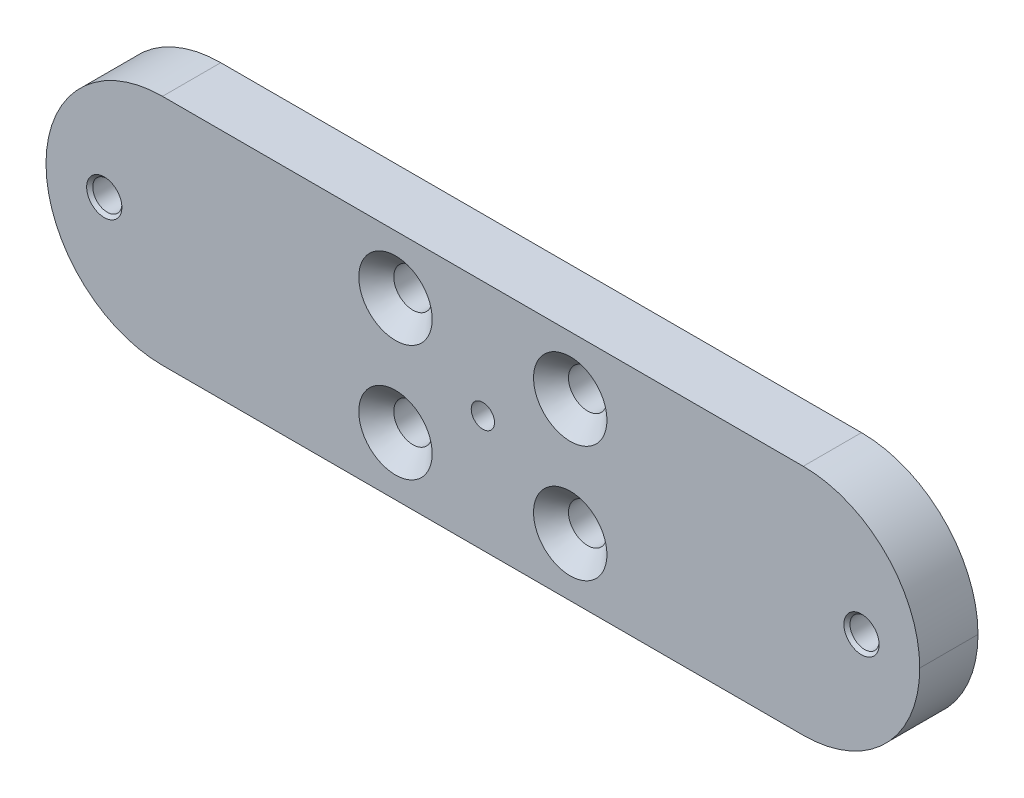
ISO-10303-21;
HEADER;
FILE_DESCRIPTION(('STEP AP214'),'2;1');
FILE_NAME('part.step','',(''),(''),'','','');
FILE_SCHEMA(('AUTOMOTIVE_DESIGN { 1 0 10303 214 1 1 1 1 }'));
ENDSEC;
DATA;
#1=APPLICATION_CONTEXT('core data for automotive mechanical design processes');
#2=APPLICATION_PROTOCOL_DEFINITION('international standard','automotive_design',2000,#1);
#3=PRODUCT_CONTEXT('',#1,'mechanical');
#4=PRODUCT('Part','Part','',(#3));
#5=PRODUCT_RELATED_PRODUCT_CATEGORY('part','',(#4));
#6=PRODUCT_DEFINITION_FORMATION('','',#4);
#7=PRODUCT_DEFINITION_CONTEXT('part definition',#1,'design');
#8=PRODUCT_DEFINITION('design','',#6,#7);
#9=PRODUCT_DEFINITION_SHAPE('','',#8);
#10=(LENGTH_UNIT() NAMED_UNIT(*) SI_UNIT(.MILLI.,.METRE.));
#11=(NAMED_UNIT(*) PLANE_ANGLE_UNIT() SI_UNIT($,.RADIAN.));
#12=(NAMED_UNIT(*) SI_UNIT($,.STERADIAN.) SOLID_ANGLE_UNIT());
#13=UNCERTAINTY_MEASURE_WITH_UNIT(LENGTH_MEASURE(1.E-05),#10,'distance_accuracy_value','');
#14=(GEOMETRIC_REPRESENTATION_CONTEXT(3) GLOBAL_UNCERTAINTY_ASSIGNED_CONTEXT((#13)) GLOBAL_UNIT_ASSIGNED_CONTEXT((#10,
#11,#12)) REPRESENTATION_CONTEXT('',''));
#15=CARTESIAN_POINT('',(0.,0.,0.));
#16=DIRECTION('',(0.,0.,1.));
#17=DIRECTION('',(1.,0.,0.));
#18=AXIS2_PLACEMENT_3D('',#15,#16,#17);
#19=CARTESIAN_POINT('',(0.,0.,10.));
#20=DIRECTION('',(0.,0.,-1.));
#21=DIRECTION('',(-1.,0.,0.));
#22=AXIS2_PLACEMENT_3D('',#19,#20,#21);
#23=PLANE('',#22);
#24=CARTESIAN_POINT('',(65.,0.,10.));
#25=DIRECTION('',(0.,0.,1.));
#26=DIRECTION('',(1.,0.,0.));
#27=AXIS2_PLACEMENT_3D('',#24,#25,#26);
#28=CIRCLE('',#27,3.025);
#29=CARTESIAN_POINT('',(68.025,0.,10.));
#30=VERTEX_POINT('',#29);
#31=EDGE_CURVE('E206',#30,#30,#28,.T.);
#32=ORIENTED_EDGE('',*,*,#31,.F.);
#33=EDGE_LOOP('',(#32));
#34=FACE_BOUND('',#33,.T.);
#35=CARTESIAN_POINT('',(-65.,0.,10.));
#36=DIRECTION('',(0.,0.,1.));
#37=DIRECTION('',(1.,0.,0.));
#38=AXIS2_PLACEMENT_3D('',#35,#36,#37);
#39=CIRCLE('',#38,3.025);
#40=CARTESIAN_POINT('',(-61.975,0.,10.));
#41=VERTEX_POINT('',#40);
#42=EDGE_CURVE('E197',#41,#41,#39,.T.);
#43=ORIENTED_EDGE('',*,*,#42,.F.);
#44=EDGE_LOOP('',(#43));
#45=FACE_BOUND('',#44,.T.);
#46=CARTESIAN_POINT('',(0.,0.,10.));
#47=DIRECTION('',(0.,0.,-1.));
#48=DIRECTION('',(-1.,0.,0.));
#49=AXIS2_PLACEMENT_3D('',#46,#47,#48);
#50=CIRCLE('',#49,2.);
#51=CARTESIAN_POINT('',(-2.,0.,10.));
#52=VERTEX_POINT('',#51);
#53=EDGE_CURVE('E186',#52,#52,#50,.T.);
#54=ORIENTED_EDGE('',*,*,#53,.T.);
#55=EDGE_LOOP('',(#54));
#56=FACE_BOUND('',#55,.T.);
#57=CARTESIAN_POINT('',(15.,10.,10.));
#58=DIRECTION('',(0.,0.,1.));
#59=DIRECTION('',(1.,0.,0.));
#60=AXIS2_PLACEMENT_3D('',#57,#58,#59);
#61=CIRCLE('',#60,6.3);
#62=CARTESIAN_POINT('',(21.3,10.,10.));
#63=VERTEX_POINT('',#62);
#64=EDGE_CURVE('E173',#63,#63,#61,.T.);
#65=ORIENTED_EDGE('',*,*,#64,.F.);
#66=EDGE_LOOP('',(#65));
#67=FACE_BOUND('',#66,.T.);
#68=CARTESIAN_POINT('',(15.,-10.,10.));
#69=DIRECTION('',(0.,0.,1.));
#70=DIRECTION('',(1.,0.,0.));
#71=AXIS2_PLACEMENT_3D('',#68,#69,#70);
#72=CIRCLE('',#71,6.3);
#73=CARTESIAN_POINT('',(21.3,-10.,10.));
#74=VERTEX_POINT('',#73);
#75=EDGE_CURVE('E164',#74,#74,#72,.T.);
#76=ORIENTED_EDGE('',*,*,#75,.F.);
#77=EDGE_LOOP('',(#76));
#78=FACE_BOUND('',#77,.T.);
#79=CARTESIAN_POINT('',(-15.,-10.,10.));
#80=DIRECTION('',(0.,0.,1.));
#81=DIRECTION('',(1.,0.,0.));
#82=AXIS2_PLACEMENT_3D('',#79,#80,#81);
#83=CIRCLE('',#82,6.3);
#84=CARTESIAN_POINT('',(-8.7,-10.,10.));
#85=VERTEX_POINT('',#84);
#86=EDGE_CURVE('E153',#85,#85,#83,.T.);
#87=ORIENTED_EDGE('',*,*,#86,.F.);
#88=EDGE_LOOP('',(#87));
#89=FACE_BOUND('',#88,.T.);
#90=DIRECTION('',(1.,0.,0.));
#91=VECTOR('',#90,1.);
#92=CARTESIAN_POINT('',(-75.,-20.,10.));
#93=LINE('',#92,#91);
#94=CARTESIAN_POINT('',(-55.,-20.,10.));
#95=VERTEX_POINT('',#94);
#96=CARTESIAN_POINT('',(55.,-20.,10.));
#97=VERTEX_POINT('',#96);
#98=EDGE_CURVE('E128',#95,#97,#93,.T.);
#99=ORIENTED_EDGE('',*,*,#98,.T.);
#100=CARTESIAN_POINT('',(55.,0.,10.));
#101=DIRECTION('',(0.,0.,-1.));
#102=DIRECTION('',(-1.,0.,0.));
#103=AXIS2_PLACEMENT_3D('',#100,#101,#102);
#104=CIRCLE('',#103,20.);
#105=CARTESIAN_POINT('',(75.,0.,10.));
#106=VERTEX_POINT('',#105);
#107=EDGE_CURVE('E123',#97,#106,#104,.F.);
#108=ORIENTED_EDGE('',*,*,#107,.T.);
#109=CARTESIAN_POINT('',(55.,0.,10.));
#110=DIRECTION('',(0.,0.,-1.));
#111=DIRECTION('',(-1.,0.,0.));
#112=AXIS2_PLACEMENT_3D('',#109,#110,#111);
#113=CIRCLE('',#112,20.);
#114=CARTESIAN_POINT('',(55.,20.,10.));
#115=VERTEX_POINT('',#114);
#116=EDGE_CURVE('E106',#106,#115,#113,.F.);
#117=ORIENTED_EDGE('',*,*,#116,.T.);
#118=DIRECTION('',(-1.,0.,0.));
#119=VECTOR('',#118,1.);
#120=CARTESIAN_POINT('',(-75.,20.,10.));
#121=LINE('',#120,#119);
#122=CARTESIAN_POINT('',(-55.,20.,10.));
#123=VERTEX_POINT('',#122);
#124=EDGE_CURVE('E133',#115,#123,#121,.T.);
#125=ORIENTED_EDGE('',*,*,#124,.T.);
#126=CARTESIAN_POINT('',(-55.,0.,10.));
#127=DIRECTION('',(0.,0.,-1.));
#128=DIRECTION('',(-1.,0.,0.));
#129=AXIS2_PLACEMENT_3D('',#126,#127,#128);
#130=CIRCLE('',#129,20.);
#131=CARTESIAN_POINT('',(-75.,0.,10.));
#132=VERTEX_POINT('',#131);
#133=EDGE_CURVE('E52',#123,#132,#130,.F.);
#134=ORIENTED_EDGE('',*,*,#133,.T.);
#135=CARTESIAN_POINT('',(-55.,0.,10.));
#136=DIRECTION('',(0.,0.,-1.));
#137=DIRECTION('',(-1.,0.,0.));
#138=AXIS2_PLACEMENT_3D('',#135,#136,#137);
#139=CIRCLE('',#138,20.);
#140=EDGE_CURVE('E120',#132,#95,#139,.F.);
#141=ORIENTED_EDGE('',*,*,#140,.T.);
#142=EDGE_LOOP('',(#99,#108,#117,#125,#134,#141));
#143=FACE_BOUND('',#142,.T.);
#144=CARTESIAN_POINT('',(-15.,10.,10.));
#145=DIRECTION('',(0.,0.,1.));
#146=DIRECTION('',(1.,0.,0.));
#147=AXIS2_PLACEMENT_3D('',#144,#145,#146);
#148=CIRCLE('',#147,6.3);
#149=CARTESIAN_POINT('',(-8.7,10.,10.));
#150=VERTEX_POINT('',#149);
#151=EDGE_CURVE('E182',#150,#150,#148,.T.);
#152=ORIENTED_EDGE('',*,*,#151,.F.);
#153=EDGE_LOOP('',(#152));
#154=FACE_BOUND('',#153,.T.);
#155=ADVANCED_FACE('F35',(#34,#45,#56,#67,#78,#89,#143,#154),#23,.F.);
#156=CARTESIAN_POINT('',(-75.,20.,10.));
#157=DIRECTION('',(0.,-1.,0.));
#158=DIRECTION('',(0.,0.,-1.));
#159=AXIS2_PLACEMENT_3D('',#156,#157,#158);
#160=PLANE('',#159);
#161=ORIENTED_EDGE('',*,*,#124,.F.);
#162=DIRECTION('',(0.,0.,-1.));
#163=VECTOR('',#162,1.);
#164=CARTESIAN_POINT('',(55.,20.,10.));
#165=LINE('',#164,#163);
#166=CARTESIAN_POINT('',(55.,20.,0.));
#167=VERTEX_POINT('',#166);
#168=EDGE_CURVE('E11',#115,#167,#165,.T.);
#169=ORIENTED_EDGE('',*,*,#168,.T.);
#170=DIRECTION('',(-1.,0.,0.));
#171=VECTOR('',#170,1.);
#172=CARTESIAN_POINT('',(-75.,20.,0.));
#173=LINE('',#172,#171);
#174=CARTESIAN_POINT('',(-55.,20.,0.));
#175=VERTEX_POINT('',#174);
#176=EDGE_CURVE('E97',#167,#175,#173,.T.);
#177=ORIENTED_EDGE('',*,*,#176,.T.);
#178=DIRECTION('',(0.,0.,-1.));
#179=VECTOR('',#178,1.);
#180=CARTESIAN_POINT('',(-55.,20.,10.));
#181=LINE('',#180,#179);
#182=EDGE_CURVE('E44',#175,#123,#181,.F.);
#183=ORIENTED_EDGE('',*,*,#182,.T.);
#184=EDGE_LOOP('',(#161,#169,#177,#183));
#185=FACE_BOUND('',#184,.T.);
#186=ADVANCED_FACE('F214',(#185),#160,.F.);
#187=CARTESIAN_POINT('',(-75.,-20.,10.));
#188=DIRECTION('',(0.,1.,0.));
#189=DIRECTION('',(0.,0.,1.));
#190=AXIS2_PLACEMENT_3D('',#187,#188,#189);
#191=PLANE('',#190);
#192=DIRECTION('',(1.,0.,0.));
#193=VECTOR('',#192,1.);
#194=CARTESIAN_POINT('',(-75.,-20.,0.));
#195=LINE('',#194,#193);
#196=CARTESIAN_POINT('',(-55.,-20.,0.));
#197=VERTEX_POINT('',#196);
#198=CARTESIAN_POINT('',(55.,-20.,0.));
#199=VERTEX_POINT('',#198);
#200=EDGE_CURVE('E132',#197,#199,#195,.T.);
#201=ORIENTED_EDGE('',*,*,#200,.T.);
#202=DIRECTION('',(0.,0.,-1.));
#203=VECTOR('',#202,1.);
#204=CARTESIAN_POINT('',(55.,-20.,10.));
#205=LINE('',#204,#203);
#206=EDGE_CURVE('E111',#199,#97,#205,.F.);
#207=ORIENTED_EDGE('',*,*,#206,.T.);
#208=ORIENTED_EDGE('',*,*,#98,.F.);
#209=DIRECTION('',(0.,0.,-1.));
#210=VECTOR('',#209,1.);
#211=CARTESIAN_POINT('',(-55.,-20.,10.));
#212=LINE('',#211,#210);
#213=EDGE_CURVE('E112',#95,#197,#212,.T.);
#214=ORIENTED_EDGE('',*,*,#213,.T.);
#215=EDGE_LOOP('',(#201,#207,#208,#214));
#216=FACE_BOUND('',#215,.T.);
#217=ADVANCED_FACE('F130',(#216),#191,.F.);
#218=CARTESIAN_POINT('',(0.,0.,0.));
#219=DIRECTION('',(0.,0.,-1.));
#220=DIRECTION('',(-1.,0.,0.));
#221=AXIS2_PLACEMENT_3D('',#218,#219,#220);
#222=PLANE('',#221);
#223=CARTESIAN_POINT('',(65.,0.,0.));
#224=DIRECTION('',(0.,0.,1.));
#225=DIRECTION('',(1.,0.,0.));
#226=AXIS2_PLACEMENT_3D('',#223,#224,#225);
#227=CIRCLE('',#226,2.5);
#228=CARTESIAN_POINT('',(67.5,0.,0.));
#229=VERTEX_POINT('',#228);
#230=EDGE_CURVE('E200',#229,#229,#227,.T.);
#231=ORIENTED_EDGE('',*,*,#230,.T.);
#232=EDGE_LOOP('',(#231));
#233=FACE_BOUND('',#232,.T.);
#234=CARTESIAN_POINT('',(-65.,0.,0.));
#235=DIRECTION('',(0.,0.,1.));
#236=DIRECTION('',(1.,0.,0.));
#237=AXIS2_PLACEMENT_3D('',#234,#235,#236);
#238=CIRCLE('',#237,2.5);
#239=CARTESIAN_POINT('',(-62.5,0.,0.));
#240=VERTEX_POINT('',#239);
#241=EDGE_CURVE('E189',#240,#240,#238,.T.);
#242=ORIENTED_EDGE('',*,*,#241,.T.);
#243=EDGE_LOOP('',(#242));
#244=FACE_BOUND('',#243,.T.);
#245=CARTESIAN_POINT('',(-15.,10.,0.));
#246=DIRECTION('',(0.,0.,1.));
#247=DIRECTION('',(1.,0.,0.));
#248=AXIS2_PLACEMENT_3D('',#245,#246,#247);
#249=CIRCLE('',#248,3.3);
#250=CARTESIAN_POINT('',(-11.7,10.,0.));
#251=VERTEX_POINT('',#250);
#252=EDGE_CURVE('E176',#251,#251,#249,.T.);
#253=ORIENTED_EDGE('',*,*,#252,.T.);
#254=EDGE_LOOP('',(#253));
#255=FACE_BOUND('',#254,.T.);
#256=CARTESIAN_POINT('',(15.,10.,0.));
#257=DIRECTION('',(0.,0.,1.));
#258=DIRECTION('',(1.,0.,0.));
#259=AXIS2_PLACEMENT_3D('',#256,#257,#258);
#260=CIRCLE('',#259,3.3);
#261=CARTESIAN_POINT('',(18.3,10.,0.));
#262=VERTEX_POINT('',#261);
#263=EDGE_CURVE('E167',#262,#262,#260,.T.);
#264=ORIENTED_EDGE('',*,*,#263,.T.);
#265=EDGE_LOOP('',(#264));
#266=FACE_BOUND('',#265,.T.);
#267=CARTESIAN_POINT('',(15.,-10.,0.));
#268=DIRECTION('',(0.,0.,1.));
#269=DIRECTION('',(1.,0.,0.));
#270=AXIS2_PLACEMENT_3D('',#267,#268,#269);
#271=CIRCLE('',#270,3.3);
#272=CARTESIAN_POINT('',(18.3,-10.,0.));
#273=VERTEX_POINT('',#272);
#274=EDGE_CURVE('E158',#273,#273,#271,.T.);
#275=ORIENTED_EDGE('',*,*,#274,.T.);
#276=EDGE_LOOP('',(#275));
#277=FACE_BOUND('',#276,.T.);
#278=CARTESIAN_POINT('',(-15.,-10.,0.));
#279=DIRECTION('',(0.,0.,1.));
#280=DIRECTION('',(1.,0.,0.));
#281=AXIS2_PLACEMENT_3D('',#278,#279,#280);
#282=CIRCLE('',#281,3.3);
#283=CARTESIAN_POINT('',(-11.7,-10.,0.));
#284=VERTEX_POINT('',#283);
#285=EDGE_CURVE('E146',#284,#284,#282,.T.);
#286=ORIENTED_EDGE('',*,*,#285,.T.);
#287=EDGE_LOOP('',(#286));
#288=FACE_BOUND('',#287,.T.);
#289=CARTESIAN_POINT('',(55.,0.,0.));
#290=DIRECTION('',(0.,0.,-1.));
#291=DIRECTION('',(-1.,0.,0.));
#292=AXIS2_PLACEMENT_3D('',#289,#290,#291);
#293=CIRCLE('',#292,20.);
#294=CARTESIAN_POINT('',(75.,0.,0.));
#295=VERTEX_POINT('',#294);
#296=EDGE_CURVE('E90',#167,#295,#293,.T.);
#297=ORIENTED_EDGE('',*,*,#296,.T.);
#298=CARTESIAN_POINT('',(55.,0.,0.));
#299=DIRECTION('',(0.,0.,-1.));
#300=DIRECTION('',(-1.,0.,0.));
#301=AXIS2_PLACEMENT_3D('',#298,#299,#300);
#302=CIRCLE('',#301,20.);
#303=EDGE_CURVE('E95',#295,#199,#302,.T.);
#304=ORIENTED_EDGE('',*,*,#303,.T.);
#305=ORIENTED_EDGE('',*,*,#200,.F.);
#306=CARTESIAN_POINT('',(-55.,0.,0.));
#307=DIRECTION('',(0.,0.,-1.));
#308=DIRECTION('',(-1.,0.,0.));
#309=AXIS2_PLACEMENT_3D('',#306,#307,#308);
#310=CIRCLE('',#309,20.);
#311=CARTESIAN_POINT('',(-75.,0.,0.));
#312=VERTEX_POINT('',#311);
#313=EDGE_CURVE('E100',#197,#312,#310,.T.);
#314=ORIENTED_EDGE('',*,*,#313,.T.);
#315=CARTESIAN_POINT('',(-55.,0.,0.));
#316=DIRECTION('',(0.,0.,-1.));
#317=DIRECTION('',(-1.,0.,0.));
#318=AXIS2_PLACEMENT_3D('',#315,#316,#317);
#319=CIRCLE('',#318,20.);
#320=EDGE_CURVE('E139',#312,#175,#319,.T.);
#321=ORIENTED_EDGE('',*,*,#320,.T.);
#322=ORIENTED_EDGE('',*,*,#176,.F.);
#323=EDGE_LOOP('',(#297,#304,#305,#314,#321,#322));
#324=FACE_BOUND('',#323,.T.);
#325=ADVANCED_FACE('F92',(#233,#244,#255,#266,#277,#288,#324),#222,.T.);
#326=CARTESIAN_POINT('',(55.,0.,10.));
#327=DIRECTION('',(0.,0.,-1.));
#328=DIRECTION('',(-1.,0.,0.));
#329=AXIS2_PLACEMENT_3D('',#326,#327,#328);
#330=CYLINDRICAL_SURFACE('',#329,20.);
#331=ORIENTED_EDGE('',*,*,#168,.F.);
#332=ORIENTED_EDGE('',*,*,#116,.F.);
#333=DIRECTION('',(0.,0.,-1.));
#334=VECTOR('',#333,1.);
#335=CARTESIAN_POINT('',(75.,0.,10.));
#336=LINE('',#335,#334);
#337=EDGE_CURVE('E104',#295,#106,#336,.F.);
#338=ORIENTED_EDGE('',*,*,#337,.F.);
#339=ORIENTED_EDGE('',*,*,#296,.F.);
#340=EDGE_LOOP('',(#331,#332,#338,#339));
#341=FACE_BOUND('',#340,.T.);
#342=ADVANCED_FACE('F105',(#341),#330,.T.);
#343=CARTESIAN_POINT('',(55.,0.,10.));
#344=DIRECTION('',(0.,0.,-1.));
#345=DIRECTION('',(-1.,0.,0.));
#346=AXIS2_PLACEMENT_3D('',#343,#344,#345);
#347=CYLINDRICAL_SURFACE('',#346,20.);
#348=ORIENTED_EDGE('',*,*,#107,.F.);
#349=ORIENTED_EDGE('',*,*,#206,.F.);
#350=ORIENTED_EDGE('',*,*,#303,.F.);
#351=ORIENTED_EDGE('',*,*,#337,.T.);
#352=EDGE_LOOP('',(#348,#349,#350,#351));
#353=FACE_BOUND('',#352,.T.);
#354=ADVANCED_FACE('F109',(#353),#347,.T.);
#355=CARTESIAN_POINT('',(-55.,0.,10.));
#356=DIRECTION('',(0.,0.,-1.));
#357=DIRECTION('',(-1.,0.,0.));
#358=AXIS2_PLACEMENT_3D('',#355,#356,#357);
#359=CYLINDRICAL_SURFACE('',#358,20.);
#360=DIRECTION('',(0.,0.,-1.));
#361=VECTOR('',#360,1.);
#362=CARTESIAN_POINT('',(-75.,0.,10.));
#363=LINE('',#362,#361);
#364=EDGE_CURVE('E39',#132,#312,#363,.T.);
#365=ORIENTED_EDGE('',*,*,#364,.F.);
#366=ORIENTED_EDGE('',*,*,#133,.F.);
#367=ORIENTED_EDGE('',*,*,#182,.F.);
#368=ORIENTED_EDGE('',*,*,#320,.F.);
#369=EDGE_LOOP('',(#365,#366,#367,#368));
#370=FACE_BOUND('',#369,.T.);
#371=ADVANCED_FACE('F37',(#370),#359,.T.);
#372=CARTESIAN_POINT('',(-55.,0.,10.));
#373=DIRECTION('',(0.,0.,-1.));
#374=DIRECTION('',(-1.,0.,0.));
#375=AXIS2_PLACEMENT_3D('',#372,#373,#374);
#376=CYLINDRICAL_SURFACE('',#375,20.);
#377=ORIENTED_EDGE('',*,*,#140,.F.);
#378=ORIENTED_EDGE('',*,*,#364,.T.);
#379=ORIENTED_EDGE('',*,*,#313,.F.);
#380=ORIENTED_EDGE('',*,*,#213,.F.);
#381=EDGE_LOOP('',(#377,#378,#379,#380));
#382=FACE_BOUND('',#381,.T.);
#383=ADVANCED_FACE('F145',(#382),#376,.T.);
#384=CARTESIAN_POINT('',(-15.,-10.,10.));
#385=DIRECTION('',(0.,0.,1.));
#386=DIRECTION('',(1.,0.,0.));
#387=AXIS2_PLACEMENT_3D('',#384,#385,#386);
#388=CYLINDRICAL_SURFACE('',#387,3.3);
#389=ORIENTED_EDGE('',*,*,#285,.F.);
#390=EDGE_LOOP('',(#389));
#391=FACE_BOUND('',#390,.T.);
#392=CARTESIAN_POINT('',(-15.,-10.,6.99999999999999));
#393=DIRECTION('',(0.,0.,1.));
#394=DIRECTION('',(1.,0.,0.));
#395=AXIS2_PLACEMENT_3D('',#392,#393,#394);
#396=CIRCLE('',#395,3.3);
#397=CARTESIAN_POINT('',(-11.7,-10.,6.99999999999999));
#398=VERTEX_POINT('',#397);
#399=EDGE_CURVE('E148',#398,#398,#396,.T.);
#400=ORIENTED_EDGE('',*,*,#399,.T.);
#401=EDGE_LOOP('',(#400));
#402=FACE_BOUND('',#401,.T.);
#403=ADVANCED_FACE('F229',(#391,#402),#388,.F.);
#404=CARTESIAN_POINT('',(-15.,-10.,10.));
#405=DIRECTION('',(0.,0.,1.));
#406=DIRECTION('',(1.,0.,0.));
#407=AXIS2_PLACEMENT_3D('',#404,#405,#406);
#408=CONICAL_SURFACE('',#407,6.3,0.785398163397448);
#409=ORIENTED_EDGE('',*,*,#399,.F.);
#410=EDGE_LOOP('',(#409));
#411=FACE_BOUND('',#410,.T.);
#412=ORIENTED_EDGE('',*,*,#86,.T.);
#413=EDGE_LOOP('',(#412));
#414=FACE_BOUND('',#413,.T.);
#415=ADVANCED_FACE('F226',(#411,#414),#408,.F.);
#416=CARTESIAN_POINT('',(15.,-10.,10.));
#417=DIRECTION('',(0.,0.,1.));
#418=DIRECTION('',(1.,0.,0.));
#419=AXIS2_PLACEMENT_3D('',#416,#417,#418);
#420=CYLINDRICAL_SURFACE('',#419,3.3);
#421=ORIENTED_EDGE('',*,*,#274,.F.);
#422=EDGE_LOOP('',(#421));
#423=FACE_BOUND('',#422,.T.);
#424=CARTESIAN_POINT('',(15.,-10.,6.99999999999999));
#425=DIRECTION('',(0.,0.,1.));
#426=DIRECTION('',(1.,0.,0.));
#427=AXIS2_PLACEMENT_3D('',#424,#425,#426);
#428=CIRCLE('',#427,3.3);
#429=CARTESIAN_POINT('',(18.3,-10.,6.99999999999999));
#430=VERTEX_POINT('',#429);
#431=EDGE_CURVE('E161',#430,#430,#428,.T.);
#432=ORIENTED_EDGE('',*,*,#431,.T.);
#433=EDGE_LOOP('',(#432));
#434=FACE_BOUND('',#433,.T.);
#435=ADVANCED_FACE('F228',(#423,#434),#420,.F.);
#436=CARTESIAN_POINT('',(15.,-10.,10.));
#437=DIRECTION('',(0.,0.,1.));
#438=DIRECTION('',(1.,0.,0.));
#439=AXIS2_PLACEMENT_3D('',#436,#437,#438);
#440=CONICAL_SURFACE('',#439,6.3,0.785398163397448);
#441=ORIENTED_EDGE('',*,*,#431,.F.);
#442=EDGE_LOOP('',(#441));
#443=FACE_BOUND('',#442,.T.);
#444=ORIENTED_EDGE('',*,*,#75,.T.);
#445=EDGE_LOOP('',(#444));
#446=FACE_BOUND('',#445,.T.);
#447=ADVANCED_FACE('F236',(#443,#446),#440,.F.);
#448=CARTESIAN_POINT('',(15.,10.,10.));
#449=DIRECTION('',(0.,0.,1.));
#450=DIRECTION('',(1.,0.,0.));
#451=AXIS2_PLACEMENT_3D('',#448,#449,#450);
#452=CYLINDRICAL_SURFACE('',#451,3.3);
#453=ORIENTED_EDGE('',*,*,#263,.F.);
#454=EDGE_LOOP('',(#453));
#455=FACE_BOUND('',#454,.T.);
#456=CARTESIAN_POINT('',(15.,10.,6.99999999999999));
#457=DIRECTION('',(0.,0.,1.));
#458=DIRECTION('',(1.,0.,0.));
#459=AXIS2_PLACEMENT_3D('',#456,#457,#458);
#460=CIRCLE('',#459,3.3);
#461=CARTESIAN_POINT('',(18.3,10.,6.99999999999999));
#462=VERTEX_POINT('',#461);
#463=EDGE_CURVE('E170',#462,#462,#460,.T.);
#464=ORIENTED_EDGE('',*,*,#463,.T.);
#465=EDGE_LOOP('',(#464));
#466=FACE_BOUND('',#465,.T.);
#467=ADVANCED_FACE('F340',(#455,#466),#452,.F.);
#468=CARTESIAN_POINT('',(15.,10.,10.));
#469=DIRECTION('',(0.,0.,1.));
#470=DIRECTION('',(1.,0.,0.));
#471=AXIS2_PLACEMENT_3D('',#468,#469,#470);
#472=CONICAL_SURFACE('',#471,6.3,0.785398163397448);
#473=ORIENTED_EDGE('',*,*,#463,.F.);
#474=EDGE_LOOP('',(#473));
#475=FACE_BOUND('',#474,.T.);
#476=ORIENTED_EDGE('',*,*,#64,.T.);
#477=EDGE_LOOP('',(#476));
#478=FACE_BOUND('',#477,.T.);
#479=ADVANCED_FACE('F330',(#475,#478),#472,.F.);
#480=CARTESIAN_POINT('',(-15.,10.,10.));
#481=DIRECTION('',(0.,0.,1.));
#482=DIRECTION('',(1.,0.,0.));
#483=AXIS2_PLACEMENT_3D('',#480,#481,#482);
#484=CYLINDRICAL_SURFACE('',#483,3.3);
#485=ORIENTED_EDGE('',*,*,#252,.F.);
#486=EDGE_LOOP('',(#485));
#487=FACE_BOUND('',#486,.T.);
#488=CARTESIAN_POINT('',(-15.,10.,6.99999999999999));
#489=DIRECTION('',(0.,0.,1.));
#490=DIRECTION('',(1.,0.,0.));
#491=AXIS2_PLACEMENT_3D('',#488,#489,#490);
#492=CIRCLE('',#491,3.3);
#493=CARTESIAN_POINT('',(-11.7,10.,6.99999999999999));
#494=VERTEX_POINT('',#493);
#495=EDGE_CURVE('E179',#494,#494,#492,.T.);
#496=ORIENTED_EDGE('',*,*,#495,.T.);
#497=EDGE_LOOP('',(#496));
#498=FACE_BOUND('',#497,.T.);
#499=ADVANCED_FACE('F320',(#487,#498),#484,.F.);
#500=CARTESIAN_POINT('',(-15.,10.,10.));
#501=DIRECTION('',(0.,0.,1.));
#502=DIRECTION('',(1.,0.,0.));
#503=AXIS2_PLACEMENT_3D('',#500,#501,#502);
#504=CONICAL_SURFACE('',#503,6.3,0.785398163397448);
#505=ORIENTED_EDGE('',*,*,#495,.F.);
#506=EDGE_LOOP('',(#505));
#507=FACE_BOUND('',#506,.T.);
#508=ORIENTED_EDGE('',*,*,#151,.T.);
#509=EDGE_LOOP('',(#508));
#510=FACE_BOUND('',#509,.T.);
#511=ADVANCED_FACE('F310',(#507,#510),#504,.F.);
#512=CARTESIAN_POINT('',(0.,0.,5.));
#513=DIRECTION('',(0.,0.,1.));
#514=DIRECTION('',(1.,0.,0.));
#515=AXIS2_PLACEMENT_3D('',#512,#513,#514);
#516=CYLINDRICAL_SURFACE('',#515,2.);
#517=CARTESIAN_POINT('',(0.,0.,5.));
#518=DIRECTION('',(0.,0.,-1.));
#519=DIRECTION('',(-1.,0.,0.));
#520=AXIS2_PLACEMENT_3D('',#517,#518,#519);
#521=CIRCLE('',#520,2.);
#522=CARTESIAN_POINT('',(-2.,0.,5.));
#523=VERTEX_POINT('',#522);
#524=EDGE_CURVE('E185',#523,#523,#521,.T.);
#525=ORIENTED_EDGE('',*,*,#524,.T.);
#526=EDGE_LOOP('',(#525));
#527=FACE_BOUND('',#526,.T.);
#528=ORIENTED_EDGE('',*,*,#53,.F.);
#529=EDGE_LOOP('',(#528));
#530=FACE_BOUND('',#529,.T.);
#531=ADVANCED_FACE('F298',(#527,#530),#516,.F.);
#532=CARTESIAN_POINT('',(0.,0.,5.));
#533=DIRECTION('',(0.,0.,-1.));
#534=DIRECTION('',(-1.,0.,0.));
#535=AXIS2_PLACEMENT_3D('',#532,#533,#534);
#536=PLANE('',#535);
#537=ORIENTED_EDGE('',*,*,#524,.F.);
#538=EDGE_LOOP('',(#537));
#539=FACE_BOUND('',#538,.T.);
#540=ADVANCED_FACE('F292',(#539),#536,.F.);
#541=CARTESIAN_POINT('',(-65.,0.,10.));
#542=DIRECTION('',(0.,0.,1.));
#543=DIRECTION('',(1.,0.,0.));
#544=AXIS2_PLACEMENT_3D('',#541,#542,#543);
#545=CYLINDRICAL_SURFACE('',#544,2.5);
#546=ORIENTED_EDGE('',*,*,#241,.F.);
#547=EDGE_LOOP('',(#546));
#548=FACE_BOUND('',#547,.T.);
#549=CARTESIAN_POINT('',(-65.,0.,9.475));
#550=DIRECTION('',(0.,0.,1.));
#551=DIRECTION('',(1.,0.,0.));
#552=AXIS2_PLACEMENT_3D('',#549,#550,#551);
#553=CIRCLE('',#552,2.5);
#554=CARTESIAN_POINT('',(-62.5,0.,9.475));
#555=VERTEX_POINT('',#554);
#556=EDGE_CURVE('E194',#555,#555,#553,.T.);
#557=ORIENTED_EDGE('',*,*,#556,.T.);
#558=EDGE_LOOP('',(#557));
#559=FACE_BOUND('',#558,.T.);
#560=ADVANCED_FACE('F297',(#548,#559),#545,.F.);
#561=CARTESIAN_POINT('',(-65.,0.,10.));
#562=DIRECTION('',(0.,0.,1.));
#563=DIRECTION('',(1.,0.,0.));
#564=AXIS2_PLACEMENT_3D('',#561,#562,#563);
#565=CONICAL_SURFACE('',#564,3.025,0.785398163397442);
#566=ORIENTED_EDGE('',*,*,#556,.F.);
#567=EDGE_LOOP('',(#566));
#568=FACE_BOUND('',#567,.T.);
#569=ORIENTED_EDGE('',*,*,#42,.T.);
#570=EDGE_LOOP('',(#569));
#571=FACE_BOUND('',#570,.T.);
#572=ADVANCED_FACE('F396',(#568,#571),#565,.F.);
#573=CARTESIAN_POINT('',(65.,0.,10.));
#574=DIRECTION('',(0.,0.,1.));
#575=DIRECTION('',(1.,0.,0.));
#576=AXIS2_PLACEMENT_3D('',#573,#574,#575);
#577=CYLINDRICAL_SURFACE('',#576,2.5);
#578=ORIENTED_EDGE('',*,*,#230,.F.);
#579=EDGE_LOOP('',(#578));
#580=FACE_BOUND('',#579,.T.);
#581=CARTESIAN_POINT('',(65.,0.,9.475));
#582=DIRECTION('',(0.,0.,1.));
#583=DIRECTION('',(1.,0.,0.));
#584=AXIS2_PLACEMENT_3D('',#581,#582,#583);
#585=CIRCLE('',#584,2.5);
#586=CARTESIAN_POINT('',(67.5,0.,9.475));
#587=VERTEX_POINT('',#586);
#588=EDGE_CURVE('E203',#587,#587,#585,.T.);
#589=ORIENTED_EDGE('',*,*,#588,.T.);
#590=EDGE_LOOP('',(#589));
#591=FACE_BOUND('',#590,.T.);
#592=ADVANCED_FACE('F400',(#580,#591),#577,.F.);
#593=CARTESIAN_POINT('',(65.,0.,10.));
#594=DIRECTION('',(0.,0.,1.));
#595=DIRECTION('',(1.,0.,0.));
#596=AXIS2_PLACEMENT_3D('',#593,#594,#595);
#597=CONICAL_SURFACE('',#596,3.025,0.785398163397442);
#598=ORIENTED_EDGE('',*,*,#588,.F.);
#599=EDGE_LOOP('',(#598));
#600=FACE_BOUND('',#599,.T.);
#601=ORIENTED_EDGE('',*,*,#31,.T.);
#602=EDGE_LOOP('',(#601));
#603=FACE_BOUND('',#602,.T.);
#604=ADVANCED_FACE('F210',(#600,#603),#597,.F.);
#605=CLOSED_SHELL('',(#155,#186,#217,#325,#342,#354,#371,#383,#403,#415,#435,#447,#467,#479,
#499,#511,#531,#540,#560,#572,#592,#604));
#606=MANIFOLD_SOLID_BREP('B2',#605);
#607=ADVANCED_BREP_SHAPE_REPRESENTATION('',(#18,#606),#14);
#608=SHAPE_DEFINITION_REPRESENTATION(#9,#607);
ENDSEC;
END-ISO-10303-21;
